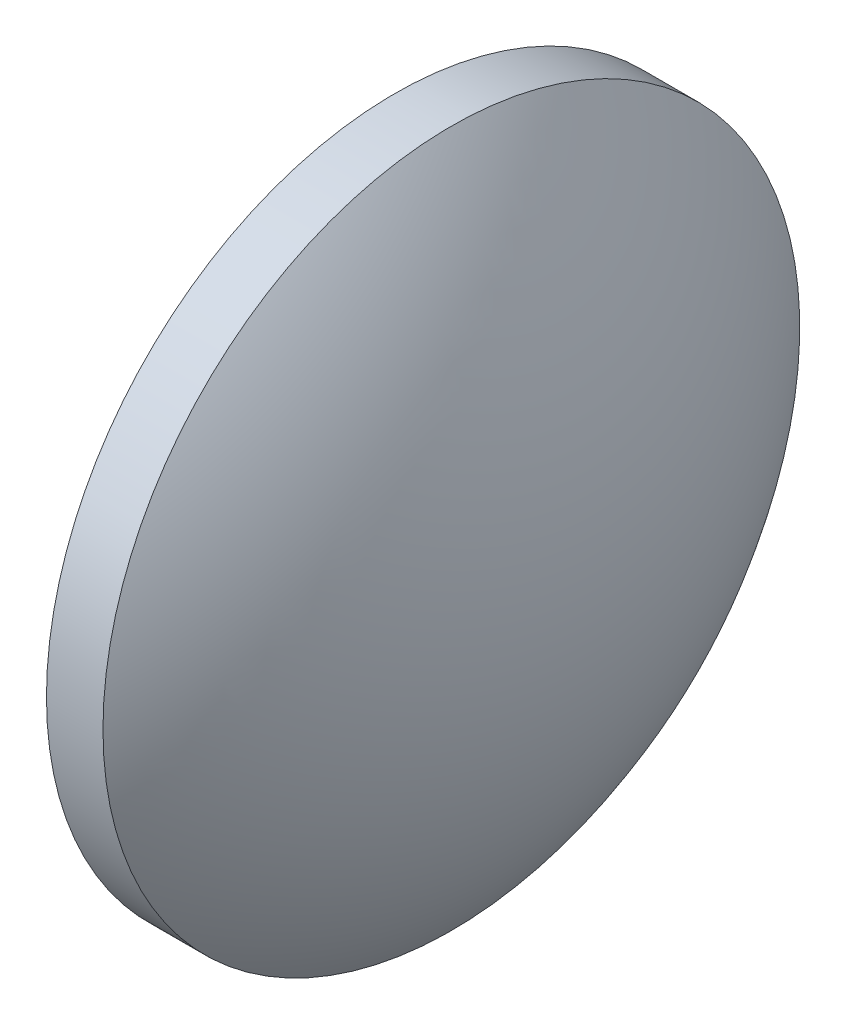
ISO-10303-21;
HEADER;
FILE_DESCRIPTION(('STEP AP214'),'2;1');
FILE_NAME('part.step','',(''),(''),'','','');
FILE_SCHEMA(('AUTOMOTIVE_DESIGN { 1 0 10303 214 1 1 1 1 }'));
ENDSEC;
DATA;
#1=APPLICATION_CONTEXT('core data for automotive mechanical design processes');
#2=APPLICATION_PROTOCOL_DEFINITION('international standard','automotive_design',2000,#1);
#3=PRODUCT_CONTEXT('',#1,'mechanical');
#4=PRODUCT('Part','Part','',(#3));
#5=PRODUCT_RELATED_PRODUCT_CATEGORY('part','',(#4));
#6=PRODUCT_DEFINITION_FORMATION('','',#4);
#7=PRODUCT_DEFINITION_CONTEXT('part definition',#1,'design');
#8=PRODUCT_DEFINITION('design','',#6,#7);
#9=PRODUCT_DEFINITION_SHAPE('','',#8);
#10=(LENGTH_UNIT() NAMED_UNIT(*) SI_UNIT(.MILLI.,.METRE.));
#11=(NAMED_UNIT(*) PLANE_ANGLE_UNIT() SI_UNIT($,.RADIAN.));
#12=(NAMED_UNIT(*) SI_UNIT($,.STERADIAN.) SOLID_ANGLE_UNIT());
#13=UNCERTAINTY_MEASURE_WITH_UNIT(LENGTH_MEASURE(1.E-05),#10,'distance_accuracy_value','');
#14=(GEOMETRIC_REPRESENTATION_CONTEXT(3) GLOBAL_UNCERTAINTY_ASSIGNED_CONTEXT((#13)) GLOBAL_UNIT_ASSIGNED_CONTEXT((#10,
#11,#12)) REPRESENTATION_CONTEXT('',''));
#15=CARTESIAN_POINT('',(0.,0.,0.));
#16=DIRECTION('',(0.,0.,1.));
#17=DIRECTION('',(1.,0.,0.));
#18=AXIS2_PLACEMENT_3D('',#15,#16,#17);
#19=CARTESIAN_POINT('',(0.,0.,0.));
#20=DIRECTION('',(0.,1.,0.));
#21=DIRECTION('',(1.,0.,0.));
#22=AXIS2_PLACEMENT_3D('',#19,#20,#21);
#23=SPHERICAL_SURFACE('',#22,500.);
#24=CARTESIAN_POINT('',(0.,0.,0.));
#25=DIRECTION('',(1.,0.,0.));
#26=DIRECTION('',(0.,0.,-1.));
#27=AXIS2_PLACEMENT_3D('',#24,#25,#26);
#28=SPHERICAL_SURFACE('',#27,500.);
#29=CARTESIAN_POINT('',(400.,0.,0.));
#30=DIRECTION('',(1.,0.,0.));
#31=DIRECTION('',(0.,0.,-1.));
#32=AXIS2_PLACEMENT_3D('',#29,#30,#31);
#33=CIRCLE('',#32,300.);
#34=CARTESIAN_POINT('',(400.,0.,-300.));
#35=VERTEX_POINT('',#34);
#36=EDGE_CURVE('E10',#35,#35,#33,.T.);
#37=ORIENTED_EDGE('',*,*,#36,.F.);
#38=EDGE_LOOP('',(#37));
#39=FACE_BOUND('',#38,.T.);
#40=ADVANCED_FACE('F39',(#39),#28,.F.);
#41=CARTESIAN_POINT('',(350.,0.,0.));
#42=DIRECTION('',(-1.,0.,0.));
#43=DIRECTION('',(0.,0.,1.));
#44=AXIS2_PLACEMENT_3D('',#41,#42,#43);
#45=PLANE('',#44);
#46=CARTESIAN_POINT('',(350.,0.,0.));
#47=DIRECTION('',(-1.,0.,0.));
#48=DIRECTION('',(0.,0.,1.));
#49=AXIS2_PLACEMENT_3D('',#46,#47,#48);
#50=CIRCLE('',#49,308.261252835967);
#51=CARTESIAN_POINT('',(350.,0.,308.261252835967));
#52=VERTEX_POINT('',#51);
#53=EDGE_CURVE('E46',#52,#52,#50,.T.);
#54=ORIENTED_EDGE('',*,*,#53,.T.);
#55=EDGE_LOOP('',(#54));
#56=FACE_BOUND('',#55,.T.);
#57=CARTESIAN_POINT('',(350.,0.,0.));
#58=DIRECTION('',(-1.,0.,0.));
#59=DIRECTION('',(0.,0.,1.));
#60=AXIS2_PLACEMENT_3D('',#57,#58,#59);
#61=CIRCLE('',#60,300.);
#62=CARTESIAN_POINT('',(350.,0.,300.));
#63=VERTEX_POINT('',#62);
#64=EDGE_CURVE('E57',#63,#63,#61,.T.);
#65=ORIENTED_EDGE('',*,*,#64,.F.);
#66=EDGE_LOOP('',(#65));
#67=FACE_BOUND('',#66,.T.);
#68=ADVANCED_FACE('F65',(#56,#67),#45,.T.);
#69=CARTESIAN_POINT('',(350.,0.,0.));
#70=DIRECTION('',(1.,0.,0.));
#71=DIRECTION('',(0.,0.,-1.));
#72=AXIS2_PLACEMENT_3D('',#69,#70,#71);
#73=CYLINDRICAL_SURFACE('',#72,308.261252835967);
#74=ORIENTED_EDGE('',*,*,#53,.F.);
#75=EDGE_LOOP('',(#74));
#76=FACE_BOUND('',#75,.T.);
#77=CARTESIAN_POINT('',(400.,0.,0.));
#78=DIRECTION('',(-1.,0.,0.));
#79=DIRECTION('',(0.,0.,1.));
#80=AXIS2_PLACEMENT_3D('',#77,#78,#79);
#81=CIRCLE('',#80,308.261252835967);
#82=CARTESIAN_POINT('',(400.,0.,308.261252835967));
#83=VERTEX_POINT('',#82);
#84=EDGE_CURVE('E51',#83,#83,#81,.T.);
#85=ORIENTED_EDGE('',*,*,#84,.T.);
#86=EDGE_LOOP('',(#85));
#87=FACE_BOUND('',#86,.T.);
#88=ADVANCED_FACE('F67',(#76,#87),#73,.T.);
#89=CARTESIAN_POINT('',(350.,0.,0.));
#90=DIRECTION('',(1.,0.,0.));
#91=DIRECTION('',(0.,0.,-1.));
#92=AXIS2_PLACEMENT_3D('',#89,#90,#91);
#93=CYLINDRICAL_SURFACE('',#92,300.);
#94=ORIENTED_EDGE('',*,*,#64,.T.);
#95=EDGE_LOOP('',(#94));
#96=FACE_BOUND('',#95,.T.);
#97=ORIENTED_EDGE('',*,*,#36,.T.);
#98=EDGE_LOOP('',(#97));
#99=FACE_BOUND('',#98,.T.);
#100=ADVANCED_FACE('F63',(#96,#99),#93,.F.);
#101=CARTESIAN_POINT('',(0.,0.,0.));
#102=DIRECTION('',(0.,1.,0.));
#103=DIRECTION('',(1.,0.,0.));
#104=AXIS2_PLACEMENT_3D('',#101,#102,#103);
#105=SPHERICAL_SURFACE('',#104,505.);
#106=CARTESIAN_POINT('',(0.,0.,0.));
#107=DIRECTION('',(-1.,0.,0.));
#108=DIRECTION('',(0.,0.,1.));
#109=AXIS2_PLACEMENT_3D('',#106,#107,#108);
#110=SPHERICAL_SURFACE('',#109,505.);
#111=ORIENTED_EDGE('',*,*,#84,.F.);
#112=EDGE_LOOP('',(#111));
#113=FACE_BOUND('',#112,.T.);
#114=ADVANCED_FACE('F77',(#113),#110,.T.);
#115=CLOSED_SHELL('',(#40,#68,#88,#100,#114));
#116=MANIFOLD_SOLID_BREP('B2',#115);
#117=ADVANCED_BREP_SHAPE_REPRESENTATION('',(#18,#116),#14);
#118=SHAPE_DEFINITION_REPRESENTATION(#9,#117);
ENDSEC;
END-ISO-10303-21;
